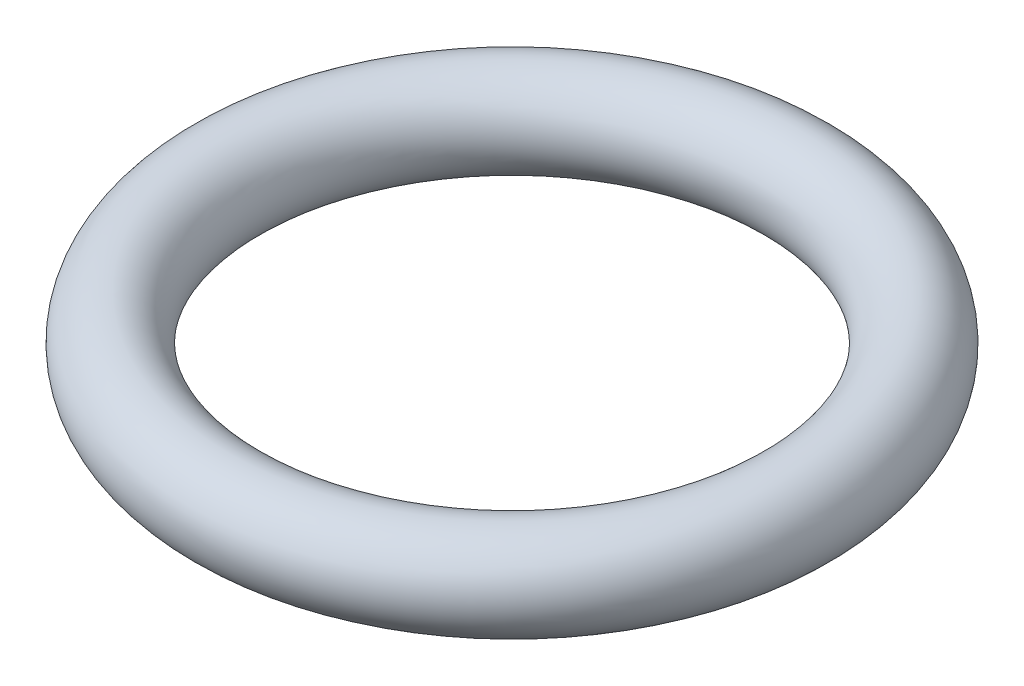
ISO-10303-21;
HEADER;
FILE_DESCRIPTION(('STEP AP214'),'2;1');
FILE_NAME('part.step','',(''),(''),'','','');
FILE_SCHEMA(('AUTOMOTIVE_DESIGN { 1 0 10303 214 1 1 1 1 }'));
ENDSEC;
DATA;
#1=APPLICATION_CONTEXT('core data for automotive mechanical design processes');
#2=APPLICATION_PROTOCOL_DEFINITION('international standard','automotive_design',2000,#1);
#3=PRODUCT_CONTEXT('',#1,'mechanical');
#4=PRODUCT('Part','Part','',(#3));
#5=PRODUCT_RELATED_PRODUCT_CATEGORY('part','',(#4));
#6=PRODUCT_DEFINITION_FORMATION('','',#4);
#7=PRODUCT_DEFINITION_CONTEXT('part definition',#1,'design');
#8=PRODUCT_DEFINITION('design','',#6,#7);
#9=PRODUCT_DEFINITION_SHAPE('','',#8);
#10=(LENGTH_UNIT() NAMED_UNIT(*) SI_UNIT(.MILLI.,.METRE.));
#11=(NAMED_UNIT(*) PLANE_ANGLE_UNIT() SI_UNIT($,.RADIAN.));
#12=(NAMED_UNIT(*) SI_UNIT($,.STERADIAN.) SOLID_ANGLE_UNIT());
#13=UNCERTAINTY_MEASURE_WITH_UNIT(LENGTH_MEASURE(1.E-05),#10,'distance_accuracy_value','');
#14=(GEOMETRIC_REPRESENTATION_CONTEXT(3) GLOBAL_UNCERTAINTY_ASSIGNED_CONTEXT((#13)) GLOBAL_UNIT_ASSIGNED_CONTEXT((#10,
#11,#12)) REPRESENTATION_CONTEXT('',''));
#15=CARTESIAN_POINT('',(0.,0.,0.));
#16=DIRECTION('',(0.,0.,1.));
#17=DIRECTION('',(1.,0.,0.));
#18=AXIS2_PLACEMENT_3D('',#15,#16,#17);
#19=CARTESIAN_POINT('',(0.,0.,0.));
#20=DIRECTION('',(0.,-1.,0.));
#21=DIRECTION('',(0.,0.,-1.));
#22=AXIS2_PLACEMENT_3D('',#19,#20,#21);
#23=TOROIDAL_SURFACE('',#22,7.5,1.2);
#24=CARTESIAN_POINT('',(0.,0.,-8.7));
#25=VERTEX_POINT('',#24);
#26=VERTEX_LOOP('',#25);
#27=FACE_BOUND('',#26,.T.);
#28=ADVANCED_FACE('F29',(#27),#23,.T.);
#29=CLOSED_SHELL('',(#28));
#30=MANIFOLD_SOLID_BREP('B2',#29);
#31=ADVANCED_BREP_SHAPE_REPRESENTATION('',(#18,#30),#14);
#32=SHAPE_DEFINITION_REPRESENTATION(#9,#31);
ENDSEC;
END-ISO-10303-21;
